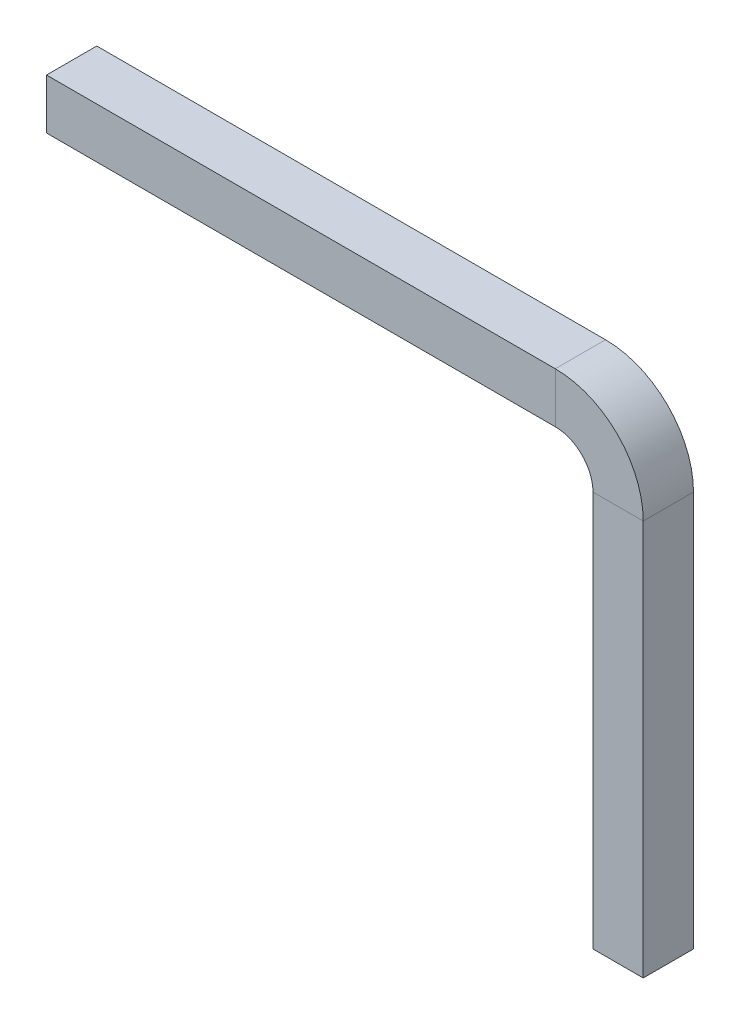
ISO-10303-21;
HEADER;
FILE_DESCRIPTION(('STEP AP214'),'2;1');
FILE_NAME('part.step','',(''),(''),'','','');
FILE_SCHEMA(('AUTOMOTIVE_DESIGN { 1 0 10303 214 1 1 1 1 }'));
ENDSEC;
DATA;
#1=APPLICATION_CONTEXT('core data for automotive mechanical design processes');
#2=APPLICATION_PROTOCOL_DEFINITION('international standard','automotive_design',2000,#1);
#3=PRODUCT_CONTEXT('',#1,'mechanical');
#4=PRODUCT('Part','Part','',(#3));
#5=PRODUCT_RELATED_PRODUCT_CATEGORY('part','',(#4));
#6=PRODUCT_DEFINITION_FORMATION('','',#4);
#7=PRODUCT_DEFINITION_CONTEXT('part definition',#1,'design');
#8=PRODUCT_DEFINITION('design','',#6,#7);
#9=PRODUCT_DEFINITION_SHAPE('','',#8);
#10=(LENGTH_UNIT() NAMED_UNIT(*) SI_UNIT(.MILLI.,.METRE.));
#11=(NAMED_UNIT(*) PLANE_ANGLE_UNIT() SI_UNIT($,.RADIAN.));
#12=(NAMED_UNIT(*) SI_UNIT($,.STERADIAN.) SOLID_ANGLE_UNIT());
#13=UNCERTAINTY_MEASURE_WITH_UNIT(LENGTH_MEASURE(1.E-05),#10,'distance_accuracy_value','');
#14=(GEOMETRIC_REPRESENTATION_CONTEXT(3) GLOBAL_UNCERTAINTY_ASSIGNED_CONTEXT((#13)) GLOBAL_UNIT_ASSIGNED_CONTEXT((#10,
#11,#12)) REPRESENTATION_CONTEXT('',''));
#15=CARTESIAN_POINT('',(0.,0.,0.));
#16=DIRECTION('',(0.,0.,1.));
#17=DIRECTION('',(1.,0.,0.));
#18=AXIS2_PLACEMENT_3D('',#15,#16,#17);
#19=CARTESIAN_POINT('',(-0.4,-1.,-0.4));
#20=DIRECTION('',(-1.,0.,0.));
#21=DIRECTION('',(0.,0.,1.));
#22=AXIS2_PLACEMENT_3D('',#19,#20,#21);
#23=PLANE('',#22);
#24=DIRECTION('',(0.,-1.,0.));
#25=VECTOR('',#24,1.);
#26=CARTESIAN_POINT('',(-0.4,-1.,-0.4));
#27=LINE('',#26,#25);
#28=CARTESIAN_POINT('',(-0.4,-1.,-0.4));
#29=VERTEX_POINT('',#28);
#30=CARTESIAN_POINT('',(-0.399999999999999,-7.3,-0.4));
#31=VERTEX_POINT('',#30);
#32=EDGE_CURVE('E187',#29,#31,#27,.T.);
#33=ORIENTED_EDGE('',*,*,#32,.T.);
#34=DIRECTION('',(0.,0.,1.));
#35=VECTOR('',#34,1.);
#36=CARTESIAN_POINT('',(-0.4,-7.3,0.4));
#37=LINE('',#36,#35);
#38=CARTESIAN_POINT('',(-0.4,-7.29999999999999,0.4));
#39=VERTEX_POINT('',#38);
#40=EDGE_CURVE('E207',#31,#39,#37,.T.);
#41=ORIENTED_EDGE('',*,*,#40,.T.);
#42=DIRECTION('',(0.,-1.,0.));
#43=VECTOR('',#42,1.);
#44=CARTESIAN_POINT('',(-0.4,-1.,0.4));
#45=LINE('',#44,#43);
#46=CARTESIAN_POINT('',(-0.4,-1.,0.4));
#47=VERTEX_POINT('',#46);
#48=EDGE_CURVE('E190',#47,#39,#45,.T.);
#49=ORIENTED_EDGE('',*,*,#48,.F.);
#50=DIRECTION('',(0.,0.,-1.));
#51=VECTOR('',#50,1.);
#52=CARTESIAN_POINT('',(-0.4,-1.,-0.4));
#53=LINE('',#52,#51);
#54=EDGE_CURVE('E134',#47,#29,#53,.T.);
#55=ORIENTED_EDGE('',*,*,#54,.T.);
#56=EDGE_LOOP('',(#33,#41,#49,#55));
#57=FACE_BOUND('',#56,.T.);
#58=ADVANCED_FACE('F33',(#57),#23,.T.);
#59=CARTESIAN_POINT('',(0.4,-1.00000000000001,-0.4));
#60=DIRECTION('',(0.,0.,-1.));
#61=DIRECTION('',(-1.,0.,0.));
#62=AXIS2_PLACEMENT_3D('',#59,#60,#61);
#63=PLANE('',#62);
#64=DIRECTION('',(0.,-1.,0.));
#65=VECTOR('',#64,1.);
#66=CARTESIAN_POINT('',(0.4,-1.00000000000001,-0.4));
#67=LINE('',#66,#65);
#68=CARTESIAN_POINT('',(0.4,-1.00000000000001,-0.4));
#69=VERTEX_POINT('',#68);
#70=CARTESIAN_POINT('',(0.400000000000001,-7.3,-0.4));
#71=VERTEX_POINT('',#70);
#72=EDGE_CURVE('E184',#69,#71,#67,.T.);
#73=ORIENTED_EDGE('',*,*,#72,.T.);
#74=DIRECTION('',(-1.,0.,0.));
#75=VECTOR('',#74,1.);
#76=CARTESIAN_POINT('',(-0.399999999999997,-7.29999999999999,-0.4));
#77=LINE('',#76,#75);
#78=EDGE_CURVE('E205',#71,#31,#77,.T.);
#79=ORIENTED_EDGE('',*,*,#78,.T.);
#80=ORIENTED_EDGE('',*,*,#32,.F.);
#81=DIRECTION('',(1.,0.,0.));
#82=VECTOR('',#81,1.);
#83=CARTESIAN_POINT('',(0.4,-1.00000000000001,-0.4));
#84=LINE('',#83,#82);
#85=EDGE_CURVE('E173',#29,#69,#84,.T.);
#86=ORIENTED_EDGE('',*,*,#85,.T.);
#87=EDGE_LOOP('',(#73,#79,#80,#86));
#88=FACE_BOUND('',#87,.T.);
#89=ADVANCED_FACE('F272',(#88),#63,.T.);
#90=CARTESIAN_POINT('',(0.4,-1.00000000000001,-0.4));
#91=DIRECTION('',(1.,0.,0.));
#92=DIRECTION('',(0.,0.,-1.));
#93=AXIS2_PLACEMENT_3D('',#90,#91,#92);
#94=PLANE('',#93);
#95=DIRECTION('',(0.,-1.,0.));
#96=VECTOR('',#95,1.);
#97=CARTESIAN_POINT('',(0.4,-1.00000000000001,0.4));
#98=LINE('',#97,#96);
#99=CARTESIAN_POINT('',(0.4,-1.00000000000001,0.4));
#100=VERTEX_POINT('',#99);
#101=CARTESIAN_POINT('',(0.4,-7.3,0.4));
#102=VERTEX_POINT('',#101);
#103=EDGE_CURVE('E137',#100,#102,#98,.T.);
#104=ORIENTED_EDGE('',*,*,#103,.T.);
#105=DIRECTION('',(0.,0.,-1.));
#106=VECTOR('',#105,1.);
#107=CARTESIAN_POINT('',(0.400000000000001,-7.3,-0.4));
#108=LINE('',#107,#106);
#109=EDGE_CURVE('E202',#102,#71,#108,.T.);
#110=ORIENTED_EDGE('',*,*,#109,.T.);
#111=ORIENTED_EDGE('',*,*,#72,.F.);
#112=DIRECTION('',(0.,0.,1.));
#113=VECTOR('',#112,1.);
#114=CARTESIAN_POINT('',(0.4,-1.00000000000001,-0.4));
#115=LINE('',#114,#113);
#116=EDGE_CURVE('E165',#69,#100,#115,.T.);
#117=ORIENTED_EDGE('',*,*,#116,.T.);
#118=EDGE_LOOP('',(#104,#110,#111,#117));
#119=FACE_BOUND('',#118,.T.);
#120=ADVANCED_FACE('F282',(#119),#94,.T.);
#121=CARTESIAN_POINT('',(0.4,-1.00000000000001,0.4));
#122=DIRECTION('',(0.,0.,1.));
#123=DIRECTION('',(1.,0.,0.));
#124=AXIS2_PLACEMENT_3D('',#121,#122,#123);
#125=PLANE('',#124);
#126=ORIENTED_EDGE('',*,*,#48,.T.);
#127=DIRECTION('',(1.,0.,0.));
#128=VECTOR('',#127,1.);
#129=CARTESIAN_POINT('',(0.400000000000003,-7.3,0.4));
#130=LINE('',#129,#128);
#131=EDGE_CURVE('E209',#39,#102,#130,.T.);
#132=ORIENTED_EDGE('',*,*,#131,.T.);
#133=ORIENTED_EDGE('',*,*,#103,.F.);
#134=DIRECTION('',(-1.,0.,0.));
#135=VECTOR('',#134,1.);
#136=CARTESIAN_POINT('',(0.4,-1.00000000000001,0.4));
#137=LINE('',#136,#135);
#138=EDGE_CURVE('E162',#100,#47,#137,.T.);
#139=ORIENTED_EDGE('',*,*,#138,.T.);
#140=EDGE_LOOP('',(#126,#132,#133,#139));
#141=FACE_BOUND('',#140,.T.);
#142=ADVANCED_FACE('F278',(#141),#125,.T.);
#143=CARTESIAN_POINT('',(-1.,-1.,0.));
#144=DIRECTION('',(0.,0.,-1.));
#145=DIRECTION('',(-1.,0.,0.));
#146=AXIS2_PLACEMENT_3D('',#143,#144,#145);
#147=CYLINDRICAL_SURFACE('',#146,0.6);
#148=DIRECTION('',(0.,0.,-1.));
#149=VECTOR('',#148,1.);
#150=CARTESIAN_POINT('',(-1.00000000000001,-0.4,-0.4));
#151=LINE('',#150,#149);
#152=CARTESIAN_POINT('',(-1.00000000000001,-0.4,0.4));
#153=VERTEX_POINT('',#152);
#154=CARTESIAN_POINT('',(-1.00000000000001,-0.4,-0.4));
#155=VERTEX_POINT('',#154);
#156=EDGE_CURVE('E131',#153,#155,#151,.T.);
#157=ORIENTED_EDGE('',*,*,#156,.T.);
#158=CARTESIAN_POINT('',(-1.,-1.,-0.4));
#159=DIRECTION('',(0.,0.,-1.));
#160=DIRECTION('',(-1.,0.,0.));
#161=AXIS2_PLACEMENT_3D('',#158,#159,#160);
#162=CIRCLE('',#161,0.6);
#163=EDGE_CURVE('E138',#155,#29,#162,.T.);
#164=ORIENTED_EDGE('',*,*,#163,.T.);
#165=ORIENTED_EDGE('',*,*,#54,.F.);
#166=CARTESIAN_POINT('',(-1.,-1.,0.4));
#167=DIRECTION('',(0.,0.,-1.));
#168=DIRECTION('',(-1.,0.,0.));
#169=AXIS2_PLACEMENT_3D('',#166,#167,#168);
#170=CIRCLE('',#169,0.6);
#171=EDGE_CURVE('E126',#153,#47,#170,.T.);
#172=ORIENTED_EDGE('',*,*,#171,.F.);
#173=EDGE_LOOP('',(#157,#164,#165,#172));
#174=FACE_BOUND('',#173,.T.);
#175=ADVANCED_FACE('F128',(#174),#147,.F.);
#176=CARTESIAN_POINT('',(-1.00000000000001,0.4,-0.4));
#177=DIRECTION('',(0.,0.,-1.));
#178=DIRECTION('',(-1.,0.,0.));
#179=AXIS2_PLACEMENT_3D('',#176,#177,#178);
#180=PLANE('',#179);
#181=DIRECTION('',(0.,1.,0.));
#182=VECTOR('',#181,1.);
#183=CARTESIAN_POINT('',(-1.00000000000001,0.4,-0.4));
#184=LINE('',#183,#182);
#185=CARTESIAN_POINT('',(-1.00000000000001,0.4,-0.4));
#186=VERTEX_POINT('',#185);
#187=EDGE_CURVE('E158',#155,#186,#184,.T.);
#188=ORIENTED_EDGE('',*,*,#187,.T.);
#189=CARTESIAN_POINT('',(-1.,-1.,-0.4));
#190=DIRECTION('',(0.,0.,-1.));
#191=DIRECTION('',(-1.,0.,0.));
#192=AXIS2_PLACEMENT_3D('',#189,#190,#191);
#193=CIRCLE('',#192,1.4);
#194=EDGE_CURVE('E178',#186,#69,#193,.T.);
#195=ORIENTED_EDGE('',*,*,#194,.T.);
#196=ORIENTED_EDGE('',*,*,#85,.F.);
#197=ORIENTED_EDGE('',*,*,#163,.F.);
#198=EDGE_LOOP('',(#188,#195,#196,#197));
#199=FACE_BOUND('',#198,.T.);
#200=ADVANCED_FACE('F270',(#199),#180,.T.);
#201=CARTESIAN_POINT('',(-1.,-1.,0.));
#202=DIRECTION('',(0.,0.,-1.));
#203=DIRECTION('',(-1.,0.,0.));
#204=AXIS2_PLACEMENT_3D('',#201,#202,#203);
#205=CYLINDRICAL_SURFACE('',#204,1.4);
#206=DIRECTION('',(0.,0.,1.));
#207=VECTOR('',#206,1.);
#208=CARTESIAN_POINT('',(-1.00000000000001,0.4,-0.4));
#209=LINE('',#208,#207);
#210=CARTESIAN_POINT('',(-1.00000000000001,0.4,0.4));
#211=VERTEX_POINT('',#210);
#212=EDGE_CURVE('E260',#186,#211,#209,.T.);
#213=ORIENTED_EDGE('',*,*,#212,.T.);
#214=CARTESIAN_POINT('',(-1.,-1.,0.4));
#215=DIRECTION('',(0.,0.,-1.));
#216=DIRECTION('',(-1.,0.,0.));
#217=AXIS2_PLACEMENT_3D('',#214,#215,#216);
#218=CIRCLE('',#217,1.4);
#219=EDGE_CURVE('E144',#211,#100,#218,.T.);
#220=ORIENTED_EDGE('',*,*,#219,.T.);
#221=ORIENTED_EDGE('',*,*,#116,.F.);
#222=ORIENTED_EDGE('',*,*,#194,.F.);
#223=EDGE_LOOP('',(#213,#220,#221,#222));
#224=FACE_BOUND('',#223,.T.);
#225=ADVANCED_FACE('F267',(#224),#205,.T.);
#226=CARTESIAN_POINT('',(-1.00000000000001,0.4,0.4));
#227=DIRECTION('',(0.,0.,1.));
#228=DIRECTION('',(1.,0.,0.));
#229=AXIS2_PLACEMENT_3D('',#226,#227,#228);
#230=PLANE('',#229);
#231=DIRECTION('',(0.,-1.,0.));
#232=VECTOR('',#231,1.);
#233=CARTESIAN_POINT('',(-1.00000000000001,0.4,0.4));
#234=LINE('',#233,#232);
#235=EDGE_CURVE('E141',#211,#153,#234,.T.);
#236=ORIENTED_EDGE('',*,*,#235,.T.);
#237=ORIENTED_EDGE('',*,*,#171,.T.);
#238=ORIENTED_EDGE('',*,*,#138,.F.);
#239=ORIENTED_EDGE('',*,*,#219,.F.);
#240=EDGE_LOOP('',(#236,#237,#238,#239));
#241=FACE_BOUND('',#240,.T.);
#242=ADVANCED_FACE('F142',(#241),#230,.T.);
#243=CARTESIAN_POINT('',(-1.00000000000001,0.4,0.4));
#244=DIRECTION('',(0.,0.,-1.));
#245=DIRECTION('',(0.,1.,0.));
#246=AXIS2_PLACEMENT_3D('',#243,#244,#245);
#247=PLANE('',#246);
#248=DIRECTION('',(-1.,0.,0.));
#249=VECTOR('',#248,1.);
#250=CARTESIAN_POINT('',(-1.00000000000001,0.4,0.4));
#251=LINE('',#250,#249);
#252=CARTESIAN_POINT('',(-9.1,0.4,0.4));
#253=VERTEX_POINT('',#252);
#254=EDGE_CURVE('E262',#211,#253,#251,.T.);
#255=ORIENTED_EDGE('',*,*,#254,.T.);
#256=DIRECTION('',(0.,-1.,0.));
#257=VECTOR('',#256,1.);
#258=CARTESIAN_POINT('',(-9.1,-0.4,0.4));
#259=LINE('',#258,#257);
#260=CARTESIAN_POINT('',(-9.1,-0.4,0.4));
#261=VERTEX_POINT('',#260);
#262=EDGE_CURVE('E11',#253,#261,#259,.T.);
#263=ORIENTED_EDGE('',*,*,#262,.T.);
#264=DIRECTION('',(-1.,0.,0.));
#265=VECTOR('',#264,1.);
#266=CARTESIAN_POINT('',(-1.00000000000001,-0.4,0.4));
#267=LINE('',#266,#265);
#268=EDGE_CURVE('E154',#153,#261,#267,.T.);
#269=ORIENTED_EDGE('',*,*,#268,.F.);
#270=ORIENTED_EDGE('',*,*,#235,.F.);
#271=EDGE_LOOP('',(#255,#263,#269,#270));
#272=FACE_BOUND('',#271,.T.);
#273=ADVANCED_FACE('F160',(#272),#247,.F.);
#274=CARTESIAN_POINT('',(-1.00000000000001,-0.4,-0.4));
#275=DIRECTION('',(0.,1.,0.));
#276=DIRECTION('',(0.,0.,1.));
#277=AXIS2_PLACEMENT_3D('',#274,#275,#276);
#278=PLANE('',#277);
#279=ORIENTED_EDGE('',*,*,#268,.T.);
#280=DIRECTION('',(0.,0.,-1.));
#281=VECTOR('',#280,1.);
#282=CARTESIAN_POINT('',(-9.1,-0.4,-0.4));
#283=LINE('',#282,#281);
#284=CARTESIAN_POINT('',(-9.1,-0.4,-0.4));
#285=VERTEX_POINT('',#284);
#286=EDGE_CURVE('E211',#261,#285,#283,.T.);
#287=ORIENTED_EDGE('',*,*,#286,.T.);
#288=DIRECTION('',(-1.,0.,0.));
#289=VECTOR('',#288,1.);
#290=CARTESIAN_POINT('',(-1.00000000000001,-0.4,-0.4));
#291=LINE('',#290,#289);
#292=EDGE_CURVE('E156',#155,#285,#291,.T.);
#293=ORIENTED_EDGE('',*,*,#292,.F.);
#294=ORIENTED_EDGE('',*,*,#156,.F.);
#295=EDGE_LOOP('',(#279,#287,#293,#294));
#296=FACE_BOUND('',#295,.T.);
#297=ADVANCED_FACE('F152',(#296),#278,.F.);
#298=CARTESIAN_POINT('',(-1.00000000000001,0.4,-0.4));
#299=DIRECTION('',(0.,0.,1.));
#300=DIRECTION('',(0.,-1.,0.));
#301=AXIS2_PLACEMENT_3D('',#298,#299,#300);
#302=PLANE('',#301);
#303=ORIENTED_EDGE('',*,*,#292,.T.);
#304=DIRECTION('',(0.,1.,0.));
#305=VECTOR('',#304,1.);
#306=CARTESIAN_POINT('',(-9.1,0.4,-0.4));
#307=LINE('',#306,#305);
#308=CARTESIAN_POINT('',(-9.1,0.4,-0.4));
#309=VERTEX_POINT('',#308);
#310=EDGE_CURVE('E57',#285,#309,#307,.T.);
#311=ORIENTED_EDGE('',*,*,#310,.T.);
#312=DIRECTION('',(-1.,0.,0.));
#313=VECTOR('',#312,1.);
#314=CARTESIAN_POINT('',(-1.00000000000001,0.4,-0.4));
#315=LINE('',#314,#313);
#316=EDGE_CURVE('E167',#186,#309,#315,.T.);
#317=ORIENTED_EDGE('',*,*,#316,.F.);
#318=ORIENTED_EDGE('',*,*,#187,.F.);
#319=EDGE_LOOP('',(#303,#311,#317,#318));
#320=FACE_BOUND('',#319,.T.);
#321=ADVANCED_FACE('F256',(#320),#302,.F.);
#322=CARTESIAN_POINT('',(-1.00000000000001,0.4,-0.4));
#323=DIRECTION('',(0.,-1.,0.));
#324=DIRECTION('',(0.,0.,-1.));
#325=AXIS2_PLACEMENT_3D('',#322,#323,#324);
#326=PLANE('',#325);
#327=ORIENTED_EDGE('',*,*,#316,.T.);
#328=DIRECTION('',(0.,0.,1.));
#329=VECTOR('',#328,1.);
#330=CARTESIAN_POINT('',(-9.1,0.4,0.4));
#331=LINE('',#330,#329);
#332=EDGE_CURVE('E42',#309,#253,#331,.T.);
#333=ORIENTED_EDGE('',*,*,#332,.T.);
#334=ORIENTED_EDGE('',*,*,#254,.F.);
#335=ORIENTED_EDGE('',*,*,#212,.F.);
#336=EDGE_LOOP('',(#327,#333,#334,#335));
#337=FACE_BOUND('',#336,.T.);
#338=ADVANCED_FACE('F265',(#337),#326,.F.);
#339=CARTESIAN_POINT('',(0.,-7.5,0.));
#340=DIRECTION('',(0.,1.,0.));
#341=DIRECTION('',(0.,0.,1.));
#342=AXIS2_PLACEMENT_3D('',#339,#340,#341);
#343=PLANE('',#342);
#344=DIRECTION('',(1.,0.,0.));
#345=VECTOR('',#344,1.);
#346=CARTESIAN_POINT('',(0.400000000000001,-7.50000000000001,-0.199999999999999));
#347=LINE('',#346,#345);
#348=CARTESIAN_POINT('',(-0.200000000000002,-7.5,-0.199999999999999));
#349=VERTEX_POINT('',#348);
#350=CARTESIAN_POINT('',(0.199999999999997,-7.5,-0.199999999999999));
#351=VERTEX_POINT('',#350);
#352=EDGE_CURVE('E197',#349,#351,#347,.T.);
#353=ORIENTED_EDGE('',*,*,#352,.T.);
#354=DIRECTION('',(0.,0.,1.));
#355=VECTOR('',#354,1.);
#356=CARTESIAN_POINT('',(0.199999999999997,-7.5,0.4));
#357=LINE('',#356,#355);
#358=CARTESIAN_POINT('',(0.199999999999997,-7.5,0.2));
#359=VERTEX_POINT('',#358);
#360=EDGE_CURVE('E199',#351,#359,#357,.T.);
#361=ORIENTED_EDGE('',*,*,#360,.T.);
#362=DIRECTION('',(-1.,0.,0.));
#363=VECTOR('',#362,1.);
#364=CARTESIAN_POINT('',(-0.399999999999999,-7.49999999999999,0.199999999999999));
#365=LINE('',#364,#363);
#366=CARTESIAN_POINT('',(-0.200000000000002,-7.5,0.2));
#367=VERTEX_POINT('',#366);
#368=EDGE_CURVE('E193',#359,#367,#365,.T.);
#369=ORIENTED_EDGE('',*,*,#368,.T.);
#370=DIRECTION('',(0.,0.,-1.));
#371=VECTOR('',#370,1.);
#372=CARTESIAN_POINT('',(-0.200000000000002,-7.5,-0.4));
#373=LINE('',#372,#371);
#374=EDGE_CURVE('E195',#367,#349,#373,.T.);
#375=ORIENTED_EDGE('',*,*,#374,.T.);
#376=EDGE_LOOP('',(#353,#361,#369,#375));
#377=FACE_BOUND('',#376,.T.);
#378=ADVANCED_FACE('F293',(#377),#343,.F.);
#379=CARTESIAN_POINT('',(-9.3,0.,0.));
#380=DIRECTION('',(-1.,0.,0.));
#381=DIRECTION('',(0.,0.,1.));
#382=AXIS2_PLACEMENT_3D('',#379,#380,#381);
#383=PLANE('',#382);
#384=DIRECTION('',(0.,-1.,0.));
#385=VECTOR('',#384,1.);
#386=CARTESIAN_POINT('',(-9.3,-0.4,-0.200000000000003));
#387=LINE('',#386,#385);
#388=CARTESIAN_POINT('',(-9.3,0.200000000000003,-0.200000000000003));
#389=VERTEX_POINT('',#388);
#390=CARTESIAN_POINT('',(-9.3,-0.200000000000003,-0.200000000000003));
#391=VERTEX_POINT('',#390);
#392=EDGE_CURVE('E217',#389,#391,#387,.T.);
#393=ORIENTED_EDGE('',*,*,#392,.T.);
#394=DIRECTION('',(0.,0.,1.));
#395=VECTOR('',#394,1.);
#396=CARTESIAN_POINT('',(-9.3,-0.200000000000003,0.4));
#397=LINE('',#396,#395);
#398=CARTESIAN_POINT('',(-9.3,-0.200000000000003,0.200000000000003));
#399=VERTEX_POINT('',#398);
#400=EDGE_CURVE('E219',#391,#399,#397,.T.);
#401=ORIENTED_EDGE('',*,*,#400,.T.);
#402=DIRECTION('',(0.,1.,0.));
#403=VECTOR('',#402,1.);
#404=CARTESIAN_POINT('',(-9.3,0.4,0.200000000000003));
#405=LINE('',#404,#403);
#406=CARTESIAN_POINT('',(-9.3,0.200000000000003,0.200000000000003));
#407=VERTEX_POINT('',#406);
#408=EDGE_CURVE('E213',#399,#407,#405,.T.);
#409=ORIENTED_EDGE('',*,*,#408,.T.);
#410=DIRECTION('',(0.,0.,-1.));
#411=VECTOR('',#410,1.);
#412=CARTESIAN_POINT('',(-9.3,0.200000000000003,-0.4));
#413=LINE('',#412,#411);
#414=EDGE_CURVE('E215',#407,#389,#413,.T.);
#415=ORIENTED_EDGE('',*,*,#414,.T.);
#416=EDGE_LOOP('',(#393,#401,#409,#415));
#417=FACE_BOUND('',#416,.T.);
#418=ADVANCED_FACE('F249',(#417),#383,.T.);
#419=CARTESIAN_POINT('',(-0.200000000000002,-7.5,0.));
#420=DIRECTION('',(-0.707106781186552,-0.707106781186542,0.));
#421=DIRECTION('',(0.,0.,1.));
#422=AXIS2_PLACEMENT_3D('',#419,#420,#421);
#423=PLANE('',#422);
#424=DIRECTION('',(0.577350269189623,-0.577350269189631,-0.577350269189624));
#425=VECTOR('',#424,1.);
#426=CARTESIAN_POINT('',(-0.133333333333334,-7.56666666666667,0.133333333333332));
#427=LINE('',#426,#425);
#428=EDGE_CURVE('E228',#39,#367,#427,.T.);
#429=ORIENTED_EDGE('',*,*,#428,.F.);
#430=ORIENTED_EDGE('',*,*,#40,.F.);
#431=DIRECTION('',(0.577350269189623,-0.577350269189631,0.577350269189624));
#432=VECTOR('',#431,1.);
#433=CARTESIAN_POINT('',(-0.133333333333336,-7.56666666666666,-0.133333333333333));
#434=LINE('',#433,#432);
#435=EDGE_CURVE('E148',#349,#31,#434,.F.);
#436=ORIENTED_EDGE('',*,*,#435,.F.);
#437=ORIENTED_EDGE('',*,*,#374,.F.);
#438=EDGE_LOOP('',(#429,#430,#436,#437));
#439=FACE_BOUND('',#438,.T.);
#440=ADVANCED_FACE('F299',(#439),#423,.T.);
#441=CARTESIAN_POINT('',(0.,-7.5,-0.199999999999999));
#442=DIRECTION('',(0.,-0.707106781186548,-0.707106781186547));
#443=DIRECTION('',(-1.,0.,0.));
#444=AXIS2_PLACEMENT_3D('',#441,#442,#443);
#445=PLANE('',#444);
#446=ORIENTED_EDGE('',*,*,#435,.T.);
#447=ORIENTED_EDGE('',*,*,#78,.F.);
#448=DIRECTION('',(-0.577350269189628,-0.57735026918962,0.577350269189629));
#449=VECTOR('',#448,1.);
#450=CARTESIAN_POINT('',(0.133333333333332,-7.56666666666667,-0.133333333333334));
#451=LINE('',#450,#449);
#452=EDGE_CURVE('E226',#351,#71,#451,.F.);
#453=ORIENTED_EDGE('',*,*,#452,.F.);
#454=ORIENTED_EDGE('',*,*,#352,.F.);
#455=EDGE_LOOP('',(#446,#447,#453,#454));
#456=FACE_BOUND('',#455,.T.);
#457=ADVANCED_FACE('F297',(#456),#445,.T.);
#458=CARTESIAN_POINT('',(0.,-7.5,0.2));
#459=DIRECTION('',(0.,-0.707106781186548,0.707106781186547));
#460=DIRECTION('',(1.,0.,0.));
#461=AXIS2_PLACEMENT_3D('',#458,#459,#460);
#462=PLANE('',#461);
#463=ORIENTED_EDGE('',*,*,#428,.T.);
#464=ORIENTED_EDGE('',*,*,#368,.F.);
#465=DIRECTION('',(0.577350269189628,0.57735026918962,0.577350269189629));
#466=VECTOR('',#465,1.);
#467=CARTESIAN_POINT('',(0.133333333333332,-7.56666666666667,0.133333333333334));
#468=LINE('',#467,#466);
#469=EDGE_CURVE('E224',#102,#359,#468,.F.);
#470=ORIENTED_EDGE('',*,*,#469,.F.);
#471=ORIENTED_EDGE('',*,*,#131,.F.);
#472=EDGE_LOOP('',(#463,#464,#470,#471));
#473=FACE_BOUND('',#472,.T.);
#474=ADVANCED_FACE('F290',(#473),#462,.T.);
#475=CARTESIAN_POINT('',(0.199999999999997,-7.5,0.));
#476=DIRECTION('',(0.707106781186542,-0.707106781186552,0.));
#477=DIRECTION('',(0.,0.,-1.));
#478=AXIS2_PLACEMENT_3D('',#475,#476,#477);
#479=PLANE('',#478);
#480=ORIENTED_EDGE('',*,*,#452,.T.);
#481=ORIENTED_EDGE('',*,*,#109,.F.);
#482=ORIENTED_EDGE('',*,*,#469,.T.);
#483=ORIENTED_EDGE('',*,*,#360,.F.);
#484=EDGE_LOOP('',(#480,#481,#482,#483));
#485=FACE_BOUND('',#484,.T.);
#486=ADVANCED_FACE('F285',(#485),#479,.T.);
#487=CARTESIAN_POINT('',(-9.1,0.4,-0.4));
#488=DIRECTION('',(-0.707106781186544,0.707106781186551,0.));
#489=DIRECTION('',(0.,0.,-1.));
#490=AXIS2_PLACEMENT_3D('',#487,#488,#489);
#491=PLANE('',#490);
#492=DIRECTION('',(-0.577350269189629,-0.577350269189624,0.577350269189624));
#493=VECTOR('',#492,1.);
#494=CARTESIAN_POINT('',(-9.1,0.4,-0.4));
#495=LINE('',#494,#493);
#496=EDGE_CURVE('E236',#389,#309,#495,.F.);
#497=ORIENTED_EDGE('',*,*,#496,.F.);
#498=ORIENTED_EDGE('',*,*,#414,.F.);
#499=DIRECTION('',(-0.577350269189629,-0.577350269189624,-0.577350269189624));
#500=VECTOR('',#499,1.);
#501=CARTESIAN_POINT('',(-9.1,0.4,0.4));
#502=LINE('',#501,#500);
#503=EDGE_CURVE('E37',#253,#407,#502,.T.);
#504=ORIENTED_EDGE('',*,*,#503,.F.);
#505=ORIENTED_EDGE('',*,*,#332,.F.);
#506=EDGE_LOOP('',(#497,#498,#504,#505));
#507=FACE_BOUND('',#506,.T.);
#508=ADVANCED_FACE('F35',(#507),#491,.T.);
#509=CARTESIAN_POINT('',(-9.1,0.4,0.4));
#510=DIRECTION('',(-0.707106781186544,0.,0.707106781186551));
#511=DIRECTION('',(0.,1.,0.));
#512=AXIS2_PLACEMENT_3D('',#509,#510,#511);
#513=PLANE('',#512);
#514=ORIENTED_EDGE('',*,*,#503,.T.);
#515=ORIENTED_EDGE('',*,*,#408,.F.);
#516=DIRECTION('',(0.577350269189629,-0.577350269189624,0.577350269189624));
#517=VECTOR('',#516,1.);
#518=CARTESIAN_POINT('',(-9.36666666666667,-0.133333333333335,0.133333333333335));
#519=LINE('',#518,#517);
#520=EDGE_CURVE('E235',#261,#399,#519,.F.);
#521=ORIENTED_EDGE('',*,*,#520,.F.);
#522=ORIENTED_EDGE('',*,*,#262,.F.);
#523=EDGE_LOOP('',(#514,#515,#521,#522));
#524=FACE_BOUND('',#523,.T.);
#525=ADVANCED_FACE('F245',(#524),#513,.T.);
#526=CARTESIAN_POINT('',(-9.1,0.4,-0.4));
#527=DIRECTION('',(-0.707106781186544,0.,-0.707106781186551));
#528=DIRECTION('',(0.,-1.,0.));
#529=AXIS2_PLACEMENT_3D('',#526,#527,#528);
#530=PLANE('',#529);
#531=ORIENTED_EDGE('',*,*,#496,.T.);
#532=ORIENTED_EDGE('',*,*,#310,.F.);
#533=DIRECTION('',(-0.577350269189629,0.577350269189624,0.577350269189624));
#534=VECTOR('',#533,1.);
#535=CARTESIAN_POINT('',(-9.36666666666667,-0.133333333333335,-0.133333333333335));
#536=LINE('',#535,#534);
#537=EDGE_CURVE('E233',#391,#285,#536,.F.);
#538=ORIENTED_EDGE('',*,*,#537,.F.);
#539=ORIENTED_EDGE('',*,*,#392,.F.);
#540=EDGE_LOOP('',(#531,#532,#538,#539));
#541=FACE_BOUND('',#540,.T.);
#542=ADVANCED_FACE('F255',(#541),#530,.T.);
#543=CARTESIAN_POINT('',(-9.1,-0.4,-0.4));
#544=DIRECTION('',(-0.707106781186544,-0.707106781186551,0.));
#545=DIRECTION('',(0.,0.,1.));
#546=AXIS2_PLACEMENT_3D('',#543,#544,#545);
#547=PLANE('',#546);
#548=ORIENTED_EDGE('',*,*,#520,.T.);
#549=ORIENTED_EDGE('',*,*,#400,.F.);
#550=ORIENTED_EDGE('',*,*,#537,.T.);
#551=ORIENTED_EDGE('',*,*,#286,.F.);
#552=EDGE_LOOP('',(#548,#549,#550,#551));
#553=FACE_BOUND('',#552,.T.);
#554=ADVANCED_FACE('F253',(#553),#547,.T.);
#555=CLOSED_SHELL('',(#58,#89,#120,#142,#175,#200,#225,#242,#273,#297,#321,#338,#378,#418,#440,
#457,#474,#486,#508,#525,#542,#554));
#556=MANIFOLD_SOLID_BREP('B2',#555);
#557=ADVANCED_BREP_SHAPE_REPRESENTATION('',(#18,#556),#14);
#558=SHAPE_DEFINITION_REPRESENTATION(#9,#557);
ENDSEC;
END-ISO-10303-21;
